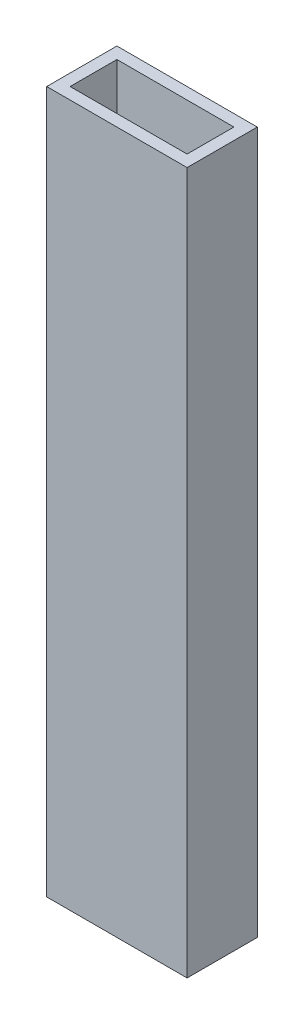
ISO-10303-21;
HEADER;
FILE_DESCRIPTION(('STEP AP214'),'2;1');
FILE_NAME('part.step','',(''),(''),'','','');
FILE_SCHEMA(('AUTOMOTIVE_DESIGN { 1 0 10303 214 1 1 1 1 }'));
ENDSEC;
DATA;
#1=APPLICATION_CONTEXT('core data for automotive mechanical design processes');
#2=APPLICATION_PROTOCOL_DEFINITION('international standard','automotive_design',2000,#1);
#3=PRODUCT_CONTEXT('',#1,'mechanical');
#4=PRODUCT('Part','Part','',(#3));
#5=PRODUCT_RELATED_PRODUCT_CATEGORY('part','',(#4));
#6=PRODUCT_DEFINITION_FORMATION('','',#4);
#7=PRODUCT_DEFINITION_CONTEXT('part definition',#1,'design');
#8=PRODUCT_DEFINITION('design','',#6,#7);
#9=PRODUCT_DEFINITION_SHAPE('','',#8);
#10=(LENGTH_UNIT() NAMED_UNIT(*) SI_UNIT(.MILLI.,.METRE.));
#11=(NAMED_UNIT(*) PLANE_ANGLE_UNIT() SI_UNIT($,.RADIAN.));
#12=(NAMED_UNIT(*) SI_UNIT($,.STERADIAN.) SOLID_ANGLE_UNIT());
#13=UNCERTAINTY_MEASURE_WITH_UNIT(LENGTH_MEASURE(1.E-05),#10,'distance_accuracy_value','');
#14=(GEOMETRIC_REPRESENTATION_CONTEXT(3) GLOBAL_UNCERTAINTY_ASSIGNED_CONTEXT((#13)) GLOBAL_UNIT_ASSIGNED_CONTEXT((#10,
#11,#12)) REPRESENTATION_CONTEXT('',''));
#15=CARTESIAN_POINT('',(0.,0.,0.));
#16=DIRECTION('',(0.,0.,1.));
#17=DIRECTION('',(1.,0.,0.));
#18=AXIS2_PLACEMENT_3D('',#15,#16,#17);
#19=CARTESIAN_POINT('',(0.,190.5,0.));
#20=DIRECTION('',(0.,-1.,0.));
#21=DIRECTION('',(0.,0.,-1.));
#22=AXIS2_PLACEMENT_3D('',#19,#20,#21);
#23=PLANE('',#22);
#24=DIRECTION('',(0.,0.,1.));
#25=VECTOR('',#24,1.);
#26=CARTESIAN_POINT('',(0.,190.5,0.));
#27=LINE('',#26,#25);
#28=CARTESIAN_POINT('',(0.,190.5,-19.05));
#29=VERTEX_POINT('',#28);
#30=CARTESIAN_POINT('',(0.,190.5,0.));
#31=VERTEX_POINT('',#30);
#32=EDGE_CURVE('E134',#29,#31,#27,.T.);
#33=ORIENTED_EDGE('',*,*,#32,.T.);
#34=DIRECTION('',(1.,0.,0.));
#35=VECTOR('',#34,1.);
#36=CARTESIAN_POINT('',(0.,190.5,0.));
#37=LINE('',#36,#35);
#38=CARTESIAN_POINT('',(38.1,190.5,0.));
#39=VERTEX_POINT('',#38);
#40=EDGE_CURVE('E137',#31,#39,#37,.T.);
#41=ORIENTED_EDGE('',*,*,#40,.T.);
#42=DIRECTION('',(0.,0.,-1.));
#43=VECTOR('',#42,1.);
#44=CARTESIAN_POINT('',(38.1,190.5,0.));
#45=LINE('',#44,#43);
#46=CARTESIAN_POINT('',(38.1,190.5,-19.05));
#47=VERTEX_POINT('',#46);
#48=EDGE_CURVE('E140',#39,#47,#45,.T.);
#49=ORIENTED_EDGE('',*,*,#48,.T.);
#50=DIRECTION('',(-1.,0.,0.));
#51=VECTOR('',#50,1.);
#52=CARTESIAN_POINT('',(0.,190.5,-19.05));
#53=LINE('',#52,#51);
#54=EDGE_CURVE('E142',#47,#29,#53,.T.);
#55=ORIENTED_EDGE('',*,*,#54,.T.);
#56=EDGE_LOOP('',(#33,#41,#49,#55));
#57=FACE_BOUND('',#56,.T.);
#58=DIRECTION('',(0.,0.,1.));
#59=VECTOR('',#58,1.);
#60=CARTESIAN_POINT('',(3.175,190.5,-3.175));
#61=LINE('',#60,#59);
#62=CARTESIAN_POINT('',(3.175,190.5,-15.875));
#63=VERTEX_POINT('',#62);
#64=CARTESIAN_POINT('',(3.175,190.5,-3.175));
#65=VERTEX_POINT('',#64);
#66=EDGE_CURVE('E98',#63,#65,#61,.T.);
#67=ORIENTED_EDGE('',*,*,#66,.F.);
#68=DIRECTION('',(-1.,0.,0.));
#69=VECTOR('',#68,1.);
#70=CARTESIAN_POINT('',(3.175,190.5,-15.875));
#71=LINE('',#70,#69);
#72=CARTESIAN_POINT('',(34.925,190.5,-15.875));
#73=VERTEX_POINT('',#72);
#74=EDGE_CURVE('E120',#73,#63,#71,.T.);
#75=ORIENTED_EDGE('',*,*,#74,.F.);
#76=DIRECTION('',(0.,0.,-1.));
#77=VECTOR('',#76,1.);
#78=CARTESIAN_POINT('',(34.925,190.5,-3.175));
#79=LINE('',#78,#77);
#80=CARTESIAN_POINT('',(34.925,190.5,-3.175));
#81=VERTEX_POINT('',#80);
#82=EDGE_CURVE('E118',#81,#73,#79,.T.);
#83=ORIENTED_EDGE('',*,*,#82,.F.);
#84=DIRECTION('',(1.,0.,0.));
#85=VECTOR('',#84,1.);
#86=CARTESIAN_POINT('',(3.175,190.5,-3.175));
#87=LINE('',#86,#85);
#88=EDGE_CURVE('E106',#65,#81,#87,.T.);
#89=ORIENTED_EDGE('',*,*,#88,.F.);
#90=EDGE_LOOP('',(#67,#75,#83,#89));
#91=FACE_BOUND('',#90,.T.);
#92=ADVANCED_FACE('F33',(#57,#91),#23,.F.);
#93=CARTESIAN_POINT('',(0.,0.,0.));
#94=DIRECTION('',(0.,-1.,0.));
#95=DIRECTION('',(0.,0.,-1.));
#96=AXIS2_PLACEMENT_3D('',#93,#94,#95);
#97=PLANE('',#96);
#98=DIRECTION('',(0.,0.,1.));
#99=VECTOR('',#98,1.);
#100=CARTESIAN_POINT('',(0.,0.,0.));
#101=LINE('',#100,#99);
#102=CARTESIAN_POINT('',(0.,0.,-19.05));
#103=VERTEX_POINT('',#102);
#104=CARTESIAN_POINT('',(0.,0.,0.));
#105=VERTEX_POINT('',#104);
#106=EDGE_CURVE('E114',#103,#105,#101,.T.);
#107=ORIENTED_EDGE('',*,*,#106,.F.);
#108=DIRECTION('',(-1.,0.,0.));
#109=VECTOR('',#108,1.);
#110=CARTESIAN_POINT('',(0.,0.,-19.05));
#111=LINE('',#110,#109);
#112=CARTESIAN_POINT('',(38.1,0.,-19.05));
#113=VERTEX_POINT('',#112);
#114=EDGE_CURVE('E138',#113,#103,#111,.T.);
#115=ORIENTED_EDGE('',*,*,#114,.F.);
#116=DIRECTION('',(0.,0.,-1.));
#117=VECTOR('',#116,1.);
#118=CARTESIAN_POINT('',(38.1,0.,0.));
#119=LINE('',#118,#117);
#120=CARTESIAN_POINT('',(38.1,0.,0.));
#121=VERTEX_POINT('',#120);
#122=EDGE_CURVE('E149',#121,#113,#119,.T.);
#123=ORIENTED_EDGE('',*,*,#122,.F.);
#124=DIRECTION('',(1.,0.,0.));
#125=VECTOR('',#124,1.);
#126=CARTESIAN_POINT('',(0.,0.,0.));
#127=LINE('',#126,#125);
#128=EDGE_CURVE('E147',#105,#121,#127,.T.);
#129=ORIENTED_EDGE('',*,*,#128,.F.);
#130=EDGE_LOOP('',(#107,#115,#123,#129));
#131=FACE_BOUND('',#130,.T.);
#132=DIRECTION('',(-1.,0.,0.));
#133=VECTOR('',#132,1.);
#134=CARTESIAN_POINT('',(3.175,0.,-15.875));
#135=LINE('',#134,#133);
#136=CARTESIAN_POINT('',(34.925,0.,-15.875));
#137=VERTEX_POINT('',#136);
#138=CARTESIAN_POINT('',(3.175,0.,-15.875));
#139=VERTEX_POINT('',#138);
#140=EDGE_CURVE('E107',#137,#139,#135,.T.);
#141=ORIENTED_EDGE('',*,*,#140,.T.);
#142=DIRECTION('',(0.,0.,1.));
#143=VECTOR('',#142,1.);
#144=CARTESIAN_POINT('',(3.175,0.,-3.175));
#145=LINE('',#144,#143);
#146=CARTESIAN_POINT('',(3.175,0.,-3.175));
#147=VERTEX_POINT('',#146);
#148=EDGE_CURVE('E56',#139,#147,#145,.T.);
#149=ORIENTED_EDGE('',*,*,#148,.T.);
#150=DIRECTION('',(1.,0.,0.));
#151=VECTOR('',#150,1.);
#152=CARTESIAN_POINT('',(3.175,0.,-3.175));
#153=LINE('',#152,#151);
#154=CARTESIAN_POINT('',(34.925,0.,-3.175));
#155=VERTEX_POINT('',#154);
#156=EDGE_CURVE('E113',#147,#155,#153,.T.);
#157=ORIENTED_EDGE('',*,*,#156,.T.);
#158=DIRECTION('',(0.,0.,-1.));
#159=VECTOR('',#158,1.);
#160=CARTESIAN_POINT('',(34.925,0.,-3.175));
#161=LINE('',#160,#159);
#162=EDGE_CURVE('E126',#155,#137,#161,.T.);
#163=ORIENTED_EDGE('',*,*,#162,.T.);
#164=EDGE_LOOP('',(#141,#149,#157,#163));
#165=FACE_BOUND('',#164,.T.);
#166=ADVANCED_FACE('F167',(#131,#165),#97,.T.);
#167=CARTESIAN_POINT('',(0.,190.5,0.));
#168=DIRECTION('',(1.,0.,0.));
#169=DIRECTION('',(0.,0.,-1.));
#170=AXIS2_PLACEMENT_3D('',#167,#168,#169);
#171=PLANE('',#170);
#172=ORIENTED_EDGE('',*,*,#106,.T.);
#173=DIRECTION('',(0.,-1.,0.));
#174=VECTOR('',#173,1.);
#175=CARTESIAN_POINT('',(0.,190.5,0.));
#176=LINE('',#175,#174);
#177=EDGE_CURVE('E11',#31,#105,#176,.T.);
#178=ORIENTED_EDGE('',*,*,#177,.F.);
#179=ORIENTED_EDGE('',*,*,#32,.F.);
#180=DIRECTION('',(0.,-1.,0.));
#181=VECTOR('',#180,1.);
#182=CARTESIAN_POINT('',(0.,190.5,-19.05));
#183=LINE('',#182,#181);
#184=EDGE_CURVE('E144',#29,#103,#183,.T.);
#185=ORIENTED_EDGE('',*,*,#184,.T.);
#186=EDGE_LOOP('',(#172,#178,#179,#185));
#187=FACE_BOUND('',#186,.T.);
#188=ADVANCED_FACE('F35',(#187),#171,.F.);
#189=CARTESIAN_POINT('',(0.,190.5,0.));
#190=DIRECTION('',(0.,0.,-1.));
#191=DIRECTION('',(-1.,0.,0.));
#192=AXIS2_PLACEMENT_3D('',#189,#190,#191);
#193=PLANE('',#192);
#194=ORIENTED_EDGE('',*,*,#128,.T.);
#195=DIRECTION('',(0.,-1.,0.));
#196=VECTOR('',#195,1.);
#197=CARTESIAN_POINT('',(38.1,190.5,0.));
#198=LINE('',#197,#196);
#199=EDGE_CURVE('E41',#39,#121,#198,.T.);
#200=ORIENTED_EDGE('',*,*,#199,.F.);
#201=ORIENTED_EDGE('',*,*,#40,.F.);
#202=ORIENTED_EDGE('',*,*,#177,.T.);
#203=EDGE_LOOP('',(#194,#200,#201,#202));
#204=FACE_BOUND('',#203,.T.);
#205=ADVANCED_FACE('F177',(#204),#193,.F.);
#206=CARTESIAN_POINT('',(38.1,190.5,0.));
#207=DIRECTION('',(-1.,0.,0.));
#208=DIRECTION('',(0.,0.,1.));
#209=AXIS2_PLACEMENT_3D('',#206,#207,#208);
#210=PLANE('',#209);
#211=ORIENTED_EDGE('',*,*,#122,.T.);
#212=DIRECTION('',(0.,-1.,0.));
#213=VECTOR('',#212,1.);
#214=CARTESIAN_POINT('',(38.1,190.5,-19.05));
#215=LINE('',#214,#213);
#216=EDGE_CURVE('E154',#47,#113,#215,.T.);
#217=ORIENTED_EDGE('',*,*,#216,.F.);
#218=ORIENTED_EDGE('',*,*,#48,.F.);
#219=ORIENTED_EDGE('',*,*,#199,.T.);
#220=EDGE_LOOP('',(#211,#217,#218,#219));
#221=FACE_BOUND('',#220,.T.);
#222=ADVANCED_FACE('F161',(#221),#210,.F.);
#223=CARTESIAN_POINT('',(0.,190.5,-19.05));
#224=DIRECTION('',(0.,0.,1.));
#225=DIRECTION('',(1.,0.,0.));
#226=AXIS2_PLACEMENT_3D('',#223,#224,#225);
#227=PLANE('',#226);
#228=ORIENTED_EDGE('',*,*,#114,.T.);
#229=ORIENTED_EDGE('',*,*,#184,.F.);
#230=ORIENTED_EDGE('',*,*,#54,.F.);
#231=ORIENTED_EDGE('',*,*,#216,.T.);
#232=EDGE_LOOP('',(#228,#229,#230,#231));
#233=FACE_BOUND('',#232,.T.);
#234=ADVANCED_FACE('F171',(#233),#227,.F.);
#235=CARTESIAN_POINT('',(3.175,190.5,-3.175));
#236=DIRECTION('',(1.,0.,0.));
#237=DIRECTION('',(0.,0.,-1.));
#238=AXIS2_PLACEMENT_3D('',#235,#236,#237);
#239=PLANE('',#238);
#240=ORIENTED_EDGE('',*,*,#148,.F.);
#241=DIRECTION('',(0.,-1.,0.));
#242=VECTOR('',#241,1.);
#243=CARTESIAN_POINT('',(3.175,190.5,-15.875));
#244=LINE('',#243,#242);
#245=EDGE_CURVE('E102',#63,#139,#244,.T.);
#246=ORIENTED_EDGE('',*,*,#245,.F.);
#247=ORIENTED_EDGE('',*,*,#66,.T.);
#248=DIRECTION('',(0.,-1.,0.));
#249=VECTOR('',#248,1.);
#250=CARTESIAN_POINT('',(3.175,190.5,-3.175));
#251=LINE('',#250,#249);
#252=EDGE_CURVE('E101',#65,#147,#251,.T.);
#253=ORIENTED_EDGE('',*,*,#252,.T.);
#254=EDGE_LOOP('',(#240,#246,#247,#253));
#255=FACE_BOUND('',#254,.T.);
#256=ADVANCED_FACE('F100',(#255),#239,.T.);
#257=CARTESIAN_POINT('',(3.175,190.5,-3.175));
#258=DIRECTION('',(0.,0.,-1.));
#259=DIRECTION('',(-1.,0.,0.));
#260=AXIS2_PLACEMENT_3D('',#257,#258,#259);
#261=PLANE('',#260);
#262=ORIENTED_EDGE('',*,*,#156,.F.);
#263=ORIENTED_EDGE('',*,*,#252,.F.);
#264=ORIENTED_EDGE('',*,*,#88,.T.);
#265=DIRECTION('',(0.,-1.,0.));
#266=VECTOR('',#265,1.);
#267=CARTESIAN_POINT('',(34.925,190.5,-3.175));
#268=LINE('',#267,#266);
#269=EDGE_CURVE('E115',#81,#155,#268,.T.);
#270=ORIENTED_EDGE('',*,*,#269,.T.);
#271=EDGE_LOOP('',(#262,#263,#264,#270));
#272=FACE_BOUND('',#271,.T.);
#273=ADVANCED_FACE('F110',(#272),#261,.T.);
#274=CARTESIAN_POINT('',(34.925,190.5,-3.175));
#275=DIRECTION('',(-1.,0.,0.));
#276=DIRECTION('',(0.,0.,1.));
#277=AXIS2_PLACEMENT_3D('',#274,#275,#276);
#278=PLANE('',#277);
#279=ORIENTED_EDGE('',*,*,#162,.F.);
#280=ORIENTED_EDGE('',*,*,#269,.F.);
#281=ORIENTED_EDGE('',*,*,#82,.T.);
#282=DIRECTION('',(0.,-1.,0.));
#283=VECTOR('',#282,1.);
#284=CARTESIAN_POINT('',(34.925,190.5,-15.875));
#285=LINE('',#284,#283);
#286=EDGE_CURVE('E48',#73,#137,#285,.T.);
#287=ORIENTED_EDGE('',*,*,#286,.T.);
#288=EDGE_LOOP('',(#279,#280,#281,#287));
#289=FACE_BOUND('',#288,.T.);
#290=ADVANCED_FACE('F200',(#289),#278,.T.);
#291=CARTESIAN_POINT('',(3.175,190.5,-15.875));
#292=DIRECTION('',(0.,0.,1.));
#293=DIRECTION('',(1.,0.,0.));
#294=AXIS2_PLACEMENT_3D('',#291,#292,#293);
#295=PLANE('',#294);
#296=ORIENTED_EDGE('',*,*,#140,.F.);
#297=ORIENTED_EDGE('',*,*,#286,.F.);
#298=ORIENTED_EDGE('',*,*,#74,.T.);
#299=ORIENTED_EDGE('',*,*,#245,.T.);
#300=EDGE_LOOP('',(#296,#297,#298,#299));
#301=FACE_BOUND('',#300,.T.);
#302=ADVANCED_FACE('F204',(#301),#295,.T.);
#303=CLOSED_SHELL('',(#92,#166,#188,#205,#222,#234,#256,#273,#290,#302));
#304=MANIFOLD_SOLID_BREP('B2',#303);
#305=ADVANCED_BREP_SHAPE_REPRESENTATION('',(#18,#304),#14);
#306=SHAPE_DEFINITION_REPRESENTATION(#9,#305);
ENDSEC;
END-ISO-10303-21;
